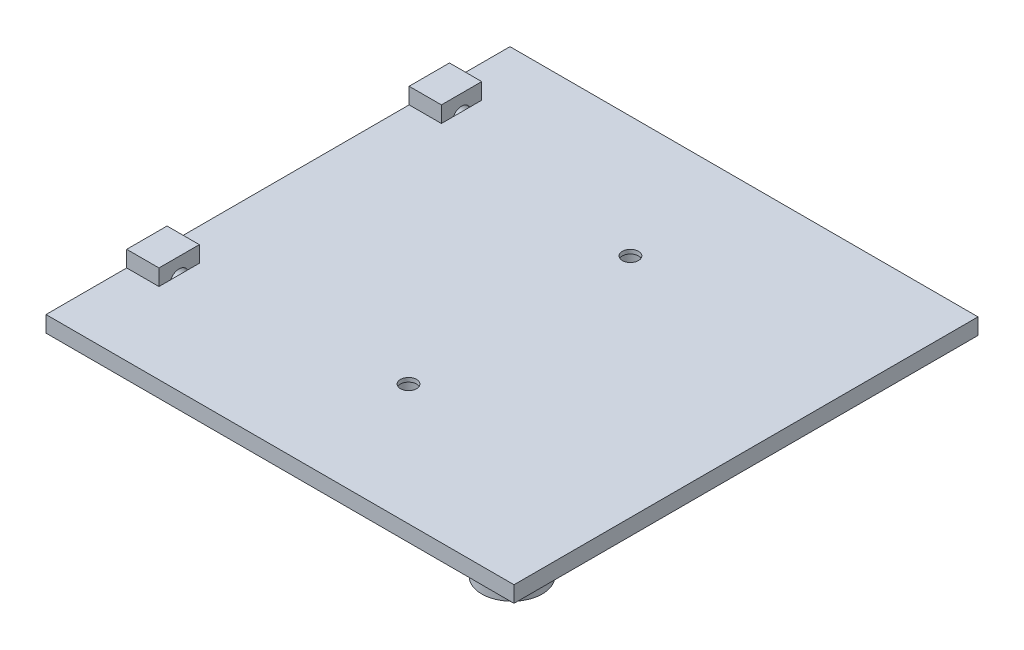
ISO-10303-21;
HEADER;
FILE_DESCRIPTION(('STEP AP214'),'2;1');
FILE_NAME('part.step','',(''),(''),'','','');
FILE_SCHEMA(('AUTOMOTIVE_DESIGN { 1 0 10303 214 1 1 1 1 }'));
ENDSEC;
DATA;
#1=APPLICATION_CONTEXT('core data for automotive mechanical design processes');
#2=APPLICATION_PROTOCOL_DEFINITION('international standard','automotive_design',2000,#1);
#3=PRODUCT_CONTEXT('',#1,'mechanical');
#4=PRODUCT('Part','Part','',(#3));
#5=PRODUCT_RELATED_PRODUCT_CATEGORY('part','',(#4));
#6=PRODUCT_DEFINITION_FORMATION('','',#4);
#7=PRODUCT_DEFINITION_CONTEXT('part definition',#1,'design');
#8=PRODUCT_DEFINITION('design','',#6,#7);
#9=PRODUCT_DEFINITION_SHAPE('','',#8);
#10=(LENGTH_UNIT() NAMED_UNIT(*) SI_UNIT(.MILLI.,.METRE.));
#11=(NAMED_UNIT(*) PLANE_ANGLE_UNIT() SI_UNIT($,.RADIAN.));
#12=(NAMED_UNIT(*) SI_UNIT($,.STERADIAN.) SOLID_ANGLE_UNIT());
#13=UNCERTAINTY_MEASURE_WITH_UNIT(LENGTH_MEASURE(1.E-05),#10,'distance_accuracy_value','');
#14=(GEOMETRIC_REPRESENTATION_CONTEXT(3) GLOBAL_UNCERTAINTY_ASSIGNED_CONTEXT((#13)) GLOBAL_UNIT_ASSIGNED_CONTEXT((#10,
#11,#12)) REPRESENTATION_CONTEXT('',''));
#15=CARTESIAN_POINT('',(0.,0.,0.));
#16=DIRECTION('',(0.,0.,1.));
#17=DIRECTION('',(1.,0.,0.));
#18=AXIS2_PLACEMENT_3D('',#15,#16,#17);
#19=CARTESIAN_POINT('',(-33.4296407851256,8.,50.6024096385542));
#20=DIRECTION('',(0.,-1.,0.));
#21=DIRECTION('',(0.,0.,-1.));
#22=AXIS2_PLACEMENT_3D('',#19,#20,#21);
#23=CYLINDRICAL_SURFACE('',#22,2.);
#24=CARTESIAN_POINT('',(-33.4296407851256,4.,50.6024096385542));
#25=DIRECTION('',(0.,1.,0.));
#26=DIRECTION('',(0.,0.,1.));
#27=AXIS2_PLACEMENT_3D('',#24,#25,#26);
#28=CIRCLE('',#27,2.);
#29=CARTESIAN_POINT('',(-33.4296407851256,4.,52.6024096385542));
#30=VERTEX_POINT('',#29);
#31=EDGE_CURVE('E266',#30,#30,#28,.F.);
#32=ORIENTED_EDGE('',*,*,#31,.F.);
#33=EDGE_LOOP('',(#32));
#34=FACE_BOUND('',#33,.T.);
#35=CARTESIAN_POINT('',(-33.4296407851256,3.,50.6024096385542));
#36=DIRECTION('',(0.,-1.,0.));
#37=DIRECTION('',(0.,0.,-1.));
#38=AXIS2_PLACEMENT_3D('',#35,#36,#37);
#39=CIRCLE('',#38,2.);
#40=CARTESIAN_POINT('',(-33.4296407851256,3.,48.6024096385542));
#41=VERTEX_POINT('',#40);
#42=EDGE_CURVE('E36',#41,#41,#39,.T.);
#43=ORIENTED_EDGE('',*,*,#42,.T.);
#44=EDGE_LOOP('',(#43));
#45=FACE_BOUND('',#44,.T.);
#46=ADVANCED_FACE('F32',(#34,#45),#23,.F.);
#47=CARTESIAN_POINT('',(-33.4296407851256,8.,-4.39759036144576));
#48=DIRECTION('',(0.,-1.,0.));
#49=DIRECTION('',(0.,0.,-1.));
#50=AXIS2_PLACEMENT_3D('',#47,#48,#49);
#51=CYLINDRICAL_SURFACE('',#50,2.);
#52=CARTESIAN_POINT('',(-33.4296407851256,4.,-4.39759036144576));
#53=DIRECTION('',(0.,1.,0.));
#54=DIRECTION('',(0.,0.,1.));
#55=AXIS2_PLACEMENT_3D('',#52,#53,#54);
#56=CIRCLE('',#55,2.);
#57=CARTESIAN_POINT('',(-33.4296407851256,4.,-2.39759036144576));
#58=VERTEX_POINT('',#57);
#59=EDGE_CURVE('E283',#58,#58,#56,.F.);
#60=ORIENTED_EDGE('',*,*,#59,.F.);
#61=EDGE_LOOP('',(#60));
#62=FACE_BOUND('',#61,.T.);
#63=CARTESIAN_POINT('',(-33.4296407851256,3.,-4.39759036144576));
#64=DIRECTION('',(0.,-1.,0.));
#65=DIRECTION('',(0.,0.,-1.));
#66=AXIS2_PLACEMENT_3D('',#63,#64,#65);
#67=CIRCLE('',#66,2.);
#68=CARTESIAN_POINT('',(-33.4296407851256,3.,-6.39759036144577));
#69=VERTEX_POINT('',#68);
#70=EDGE_CURVE('E260',#69,#69,#67,.T.);
#71=ORIENTED_EDGE('',*,*,#70,.T.);
#72=EDGE_LOOP('',(#71));
#73=FACE_BOUND('',#72,.T.);
#74=ADVANCED_FACE('F298',(#62,#73),#51,.F.);
#75=CARTESIAN_POINT('',(-93.2831325301205,4.,-34.3975903614458));
#76=DIRECTION('',(1.,0.,0.));
#77=DIRECTION('',(0.,0.,-1.));
#78=AXIS2_PLACEMENT_3D('',#75,#76,#77);
#79=PLANE('',#78);
#80=CARTESIAN_POINT('',(-93.2831325301205,3.,-14.3975903614458));
#81=DIRECTION('',(-1.,0.,0.));
#82=DIRECTION('',(0.,0.,1.));
#83=AXIS2_PLACEMENT_3D('',#80,#81,#82);
#84=CIRCLE('',#83,2.2256094163191);
#85=CARTESIAN_POINT('',(-93.2831325301205,3.,-12.1719809451267));
#86=VERTEX_POINT('',#85);
#87=EDGE_CURVE('E146',#86,#86,#84,.T.);
#88=ORIENTED_EDGE('',*,*,#87,.F.);
#89=EDGE_LOOP('',(#88));
#90=FACE_BOUND('',#89,.T.);
#91=CARTESIAN_POINT('',(-93.2831325301205,3.,55.6024096385542));
#92=DIRECTION('',(-1.,0.,0.));
#93=DIRECTION('',(0.,0.,1.));
#94=AXIS2_PLACEMENT_3D('',#91,#92,#93);
#95=CIRCLE('',#94,2.30252444093149);
#96=CARTESIAN_POINT('',(-93.2831325301205,3.,57.9049340794857));
#97=VERTEX_POINT('',#96);
#98=EDGE_CURVE('E138',#97,#97,#95,.T.);
#99=ORIENTED_EDGE('',*,*,#98,.F.);
#100=EDGE_LOOP('',(#99));
#101=FACE_BOUND('',#100,.T.);
#102=DIRECTION('',(0.,0.,1.));
#103=VECTOR('',#102,1.);
#104=CARTESIAN_POINT('',(-93.2831325301205,0.,-34.3975903614458));
#105=LINE('',#104,#103);
#106=CARTESIAN_POINT('',(-93.2831325301205,0.,-34.3975903614458));
#107=VERTEX_POINT('',#106);
#108=CARTESIAN_POINT('',(-93.2831325301205,0.,80.6024096385542));
#109=VERTEX_POINT('',#108);
#110=EDGE_CURVE('E225',#107,#109,#105,.T.);
#111=ORIENTED_EDGE('',*,*,#110,.T.);
#112=DIRECTION('',(0.,-1.,0.));
#113=VECTOR('',#112,1.);
#114=CARTESIAN_POINT('',(-93.2831325301205,4.,80.6024096385542));
#115=LINE('',#114,#113);
#116=CARTESIAN_POINT('',(-93.2831325301205,4.,80.6024096385542));
#117=VERTEX_POINT('',#116);
#118=EDGE_CURVE('E256',#117,#109,#115,.T.);
#119=ORIENTED_EDGE('',*,*,#118,.F.);
#120=DIRECTION('',(0.,0.,1.));
#121=VECTOR('',#120,1.);
#122=CARTESIAN_POINT('',(-93.2831325301205,4.,-34.3975903614458));
#123=LINE('',#122,#121);
#124=CARTESIAN_POINT('',(-93.2831325301205,4.,60.6024096385542));
#125=VERTEX_POINT('',#124);
#126=EDGE_CURVE('E233',#125,#117,#123,.T.);
#127=ORIENTED_EDGE('',*,*,#126,.F.);
#128=DIRECTION('',(0.,1.,0.));
#129=VECTOR('',#128,1.);
#130=CARTESIAN_POINT('',(-93.2831325301205,4.,60.6024096385542));
#131=LINE('',#130,#129);
#132=CARTESIAN_POINT('',(-93.2831325301205,8.,60.6024096385542));
#133=VERTEX_POINT('',#132);
#134=EDGE_CURVE('E171',#125,#133,#131,.T.);
#135=ORIENTED_EDGE('',*,*,#134,.T.);
#136=DIRECTION('',(0.,0.,-1.));
#137=VECTOR('',#136,1.);
#138=CARTESIAN_POINT('',(-93.2831325301205,8.,50.6024096385542));
#139=LINE('',#138,#137);
#140=CARTESIAN_POINT('',(-93.2831325301205,8.,50.6024096385542));
#141=VERTEX_POINT('',#140);
#142=EDGE_CURVE('E175',#133,#141,#139,.T.);
#143=ORIENTED_EDGE('',*,*,#142,.T.);
#144=DIRECTION('',(0.,-1.,0.));
#145=VECTOR('',#144,1.);
#146=CARTESIAN_POINT('',(-93.2831325301205,4.,50.6024096385542));
#147=LINE('',#146,#145);
#148=CARTESIAN_POINT('',(-93.2831325301205,4.,50.6024096385542));
#149=VERTEX_POINT('',#148);
#150=EDGE_CURVE('E168',#141,#149,#147,.T.);
#151=ORIENTED_EDGE('',*,*,#150,.T.);
#152=CARTESIAN_POINT('',(-93.2831325301205,4.,-9.39759036144578));
#153=VERTEX_POINT('',#152);
#154=EDGE_CURVE('E232',#153,#149,#123,.T.);
#155=ORIENTED_EDGE('',*,*,#154,.F.);
#156=DIRECTION('',(0.,1.,0.));
#157=VECTOR('',#156,1.);
#158=CARTESIAN_POINT('',(-93.2831325301205,4.,-9.39759036144577));
#159=LINE('',#158,#157);
#160=CARTESIAN_POINT('',(-93.2831325301205,8.,-9.39759036144577));
#161=VERTEX_POINT('',#160);
#162=EDGE_CURVE('E205',#153,#161,#159,.T.);
#163=ORIENTED_EDGE('',*,*,#162,.T.);
#164=DIRECTION('',(0.,0.,-1.));
#165=VECTOR('',#164,1.);
#166=CARTESIAN_POINT('',(-93.2831325301205,8.,-19.3975903614458));
#167=LINE('',#166,#165);
#168=CARTESIAN_POINT('',(-93.2831325301205,8.,-19.3975903614458));
#169=VERTEX_POINT('',#168);
#170=EDGE_CURVE('E191',#161,#169,#167,.T.);
#171=ORIENTED_EDGE('',*,*,#170,.T.);
#172=DIRECTION('',(0.,-1.,0.));
#173=VECTOR('',#172,1.);
#174=CARTESIAN_POINT('',(-93.2831325301205,4.,-19.3975903614458));
#175=LINE('',#174,#173);
#176=CARTESIAN_POINT('',(-93.2831325301205,4.,-19.3975903614458));
#177=VERTEX_POINT('',#176);
#178=EDGE_CURVE('E180',#169,#177,#175,.T.);
#179=ORIENTED_EDGE('',*,*,#178,.T.);
#180=CARTESIAN_POINT('',(-93.2831325301205,4.,-34.3975903614458));
#181=VERTEX_POINT('',#180);
#182=EDGE_CURVE('E228',#181,#177,#123,.T.);
#183=ORIENTED_EDGE('',*,*,#182,.F.);
#184=DIRECTION('',(0.,-1.,0.));
#185=VECTOR('',#184,1.);
#186=CARTESIAN_POINT('',(-93.2831325301205,4.,-34.3975903614458));
#187=LINE('',#186,#185);
#188=EDGE_CURVE('E239',#181,#107,#187,.T.);
#189=ORIENTED_EDGE('',*,*,#188,.T.);
#190=EDGE_LOOP('',(#111,#119,#127,#135,#143,#151,#155,#163,#171,#179,#183,#189));
#191=FACE_BOUND('',#190,.T.);
#192=ADVANCED_FACE('F34',(#90,#101,#191),#79,.F.);
#193=CARTESIAN_POINT('',(-93.2831325301205,4.,80.6024096385542));
#194=DIRECTION('',(0.,0.,-1.));
#195=DIRECTION('',(-1.,0.,0.));
#196=AXIS2_PLACEMENT_3D('',#193,#194,#195);
#197=PLANE('',#196);
#198=DIRECTION('',(1.,0.,0.));
#199=VECTOR('',#198,1.);
#200=CARTESIAN_POINT('',(-93.2831325301205,0.,80.6024096385542));
#201=LINE('',#200,#199);
#202=CARTESIAN_POINT('',(22.7168674698795,0.,80.6024096385542));
#203=VERTEX_POINT('',#202);
#204=EDGE_CURVE('E242',#109,#203,#201,.T.);
#205=ORIENTED_EDGE('',*,*,#204,.T.);
#206=DIRECTION('',(0.,-1.,0.));
#207=VECTOR('',#206,1.);
#208=CARTESIAN_POINT('',(22.7168674698795,4.,80.6024096385542));
#209=LINE('',#208,#207);
#210=CARTESIAN_POINT('',(22.7168674698795,4.,80.6024096385542));
#211=VERTEX_POINT('',#210);
#212=EDGE_CURVE('E253',#211,#203,#209,.T.);
#213=ORIENTED_EDGE('',*,*,#212,.F.);
#214=DIRECTION('',(1.,0.,0.));
#215=VECTOR('',#214,1.);
#216=CARTESIAN_POINT('',(-93.2831325301205,4.,80.6024096385542));
#217=LINE('',#216,#215);
#218=EDGE_CURVE('E231',#117,#211,#217,.T.);
#219=ORIENTED_EDGE('',*,*,#218,.F.);
#220=ORIENTED_EDGE('',*,*,#118,.T.);
#221=EDGE_LOOP('',(#205,#213,#219,#220));
#222=FACE_BOUND('',#221,.T.);
#223=ADVANCED_FACE('F297',(#222),#197,.F.);
#224=CARTESIAN_POINT('',(22.7168674698795,4.,-34.3975903614458));
#225=DIRECTION('',(-1.,0.,0.));
#226=DIRECTION('',(0.,0.,1.));
#227=AXIS2_PLACEMENT_3D('',#224,#225,#226);
#228=PLANE('',#227);
#229=DIRECTION('',(0.,0.,-1.));
#230=VECTOR('',#229,1.);
#231=CARTESIAN_POINT('',(22.7168674698795,0.,-34.3975903614458));
#232=LINE('',#231,#230);
#233=CARTESIAN_POINT('',(22.7168674698795,0.,-34.3975903614458));
#234=VERTEX_POINT('',#233);
#235=EDGE_CURVE('E244',#203,#234,#232,.T.);
#236=ORIENTED_EDGE('',*,*,#235,.T.);
#237=DIRECTION('',(0.,-1.,0.));
#238=VECTOR('',#237,1.);
#239=CARTESIAN_POINT('',(22.7168674698795,4.,-34.3975903614458));
#240=LINE('',#239,#238);
#241=CARTESIAN_POINT('',(22.7168674698795,4.,-34.3975903614458));
#242=VERTEX_POINT('',#241);
#243=EDGE_CURVE('E250',#242,#234,#240,.T.);
#244=ORIENTED_EDGE('',*,*,#243,.F.);
#245=DIRECTION('',(0.,0.,-1.));
#246=VECTOR('',#245,1.);
#247=CARTESIAN_POINT('',(22.7168674698795,4.,-34.3975903614458));
#248=LINE('',#247,#246);
#249=EDGE_CURVE('E235',#211,#242,#248,.T.);
#250=ORIENTED_EDGE('',*,*,#249,.F.);
#251=ORIENTED_EDGE('',*,*,#212,.T.);
#252=EDGE_LOOP('',(#236,#244,#250,#251));
#253=FACE_BOUND('',#252,.T.);
#254=ADVANCED_FACE('F526',(#253),#228,.F.);
#255=CARTESIAN_POINT('',(-93.2831325301205,4.,-34.3975903614458));
#256=DIRECTION('',(0.,0.,1.));
#257=DIRECTION('',(1.,0.,0.));
#258=AXIS2_PLACEMENT_3D('',#255,#256,#257);
#259=PLANE('',#258);
#260=DIRECTION('',(-1.,0.,0.));
#261=VECTOR('',#260,1.);
#262=CARTESIAN_POINT('',(-93.2831325301205,0.,-34.3975903614458));
#263=LINE('',#262,#261);
#264=EDGE_CURVE('E246',#234,#107,#263,.T.);
#265=ORIENTED_EDGE('',*,*,#264,.T.);
#266=ORIENTED_EDGE('',*,*,#188,.F.);
#267=DIRECTION('',(-1.,0.,0.));
#268=VECTOR('',#267,1.);
#269=CARTESIAN_POINT('',(-93.2831325301205,4.,-34.3975903614458));
#270=LINE('',#269,#268);
#271=EDGE_CURVE('E237',#242,#181,#270,.T.);
#272=ORIENTED_EDGE('',*,*,#271,.F.);
#273=ORIENTED_EDGE('',*,*,#243,.T.);
#274=EDGE_LOOP('',(#265,#266,#272,#273));
#275=FACE_BOUND('',#274,.T.);
#276=ADVANCED_FACE('F532',(#275),#259,.F.);
#277=CARTESIAN_POINT('',(0.,4.,0.));
#278=DIRECTION('',(0.,1.,0.));
#279=DIRECTION('',(0.,0.,1.));
#280=AXIS2_PLACEMENT_3D('',#277,#278,#279);
#281=PLANE('',#280);
#282=ORIENTED_EDGE('',*,*,#59,.T.);
#283=EDGE_LOOP('',(#282));
#284=FACE_BOUND('',#283,.T.);
#285=ORIENTED_EDGE('',*,*,#31,.T.);
#286=EDGE_LOOP('',(#285));
#287=FACE_BOUND('',#286,.T.);
#288=DIRECTION('',(-1.,0.,0.));
#289=VECTOR('',#288,1.);
#290=CARTESIAN_POINT('',(-85.2831325301205,4.,50.6024096385542));
#291=LINE('',#290,#289);
#292=CARTESIAN_POINT('',(-85.2831325301205,4.,50.6024096385542));
#293=VERTEX_POINT('',#292);
#294=EDGE_CURVE('E167',#293,#149,#291,.T.);
#295=ORIENTED_EDGE('',*,*,#294,.F.);
#296=DIRECTION('',(0.,0.,1.));
#297=VECTOR('',#296,1.);
#298=CARTESIAN_POINT('',(-85.2831325301205,4.,50.6024096385542));
#299=LINE('',#298,#297);
#300=CARTESIAN_POINT('',(-85.2831325301205,4.,53.5283752123484));
#301=VERTEX_POINT('',#300);
#302=EDGE_CURVE('E158',#293,#301,#299,.T.);
#303=ORIENTED_EDGE('',*,*,#302,.T.);
#304=CARTESIAN_POINT('',(-85.2831325301205,4.,57.6764440647601));
#305=VERTEX_POINT('',#304);
#306=EDGE_CURVE('E135',#301,#305,#299,.T.);
#307=ORIENTED_EDGE('',*,*,#306,.T.);
#308=CARTESIAN_POINT('',(-85.2831325301205,4.,60.6024096385542));
#309=VERTEX_POINT('',#308);
#310=EDGE_CURVE('E148',#305,#309,#299,.T.);
#311=ORIENTED_EDGE('',*,*,#310,.T.);
#312=DIRECTION('',(-1.,0.,0.));
#313=VECTOR('',#312,1.);
#314=CARTESIAN_POINT('',(-85.2831325301205,4.,60.6024096385542));
#315=LINE('',#314,#313);
#316=EDGE_CURVE('E183',#309,#125,#315,.T.);
#317=ORIENTED_EDGE('',*,*,#316,.T.);
#318=ORIENTED_EDGE('',*,*,#126,.T.);
#319=ORIENTED_EDGE('',*,*,#218,.T.);
#320=ORIENTED_EDGE('',*,*,#249,.T.);
#321=ORIENTED_EDGE('',*,*,#271,.T.);
#322=ORIENTED_EDGE('',*,*,#182,.T.);
#323=DIRECTION('',(-1.,0.,0.));
#324=VECTOR('',#323,1.);
#325=CARTESIAN_POINT('',(-85.2831325301205,4.,-19.3975903614458));
#326=LINE('',#325,#324);
#327=CARTESIAN_POINT('',(-85.2831325301205,4.,-19.3975903614458));
#328=VERTEX_POINT('',#327);
#329=EDGE_CURVE('E202',#328,#177,#326,.T.);
#330=ORIENTED_EDGE('',*,*,#329,.F.);
#331=DIRECTION('',(0.,0.,1.));
#332=VECTOR('',#331,1.);
#333=CARTESIAN_POINT('',(-85.2831325301205,4.,-19.3975903614458));
#334=LINE('',#333,#332);
#335=CARTESIAN_POINT('',(-85.2831325301205,4.,-16.3858904580127));
#336=VERTEX_POINT('',#335);
#337=EDGE_CURVE('E192',#328,#336,#334,.T.);
#338=ORIENTED_EDGE('',*,*,#337,.T.);
#339=CARTESIAN_POINT('',(-85.2831325301205,4.,-12.4092902648788));
#340=VERTEX_POINT('',#339);
#341=EDGE_CURVE('E196',#336,#340,#334,.T.);
#342=ORIENTED_EDGE('',*,*,#341,.T.);
#343=CARTESIAN_POINT('',(-85.2831325301205,4.,-9.39759036144577));
#344=VERTEX_POINT('',#343);
#345=EDGE_CURVE('E190',#340,#344,#334,.T.);
#346=ORIENTED_EDGE('',*,*,#345,.T.);
#347=DIRECTION('',(-1.,0.,0.));
#348=VECTOR('',#347,1.);
#349=CARTESIAN_POINT('',(-85.2831325301205,4.,-9.39759036144577));
#350=LINE('',#349,#348);
#351=EDGE_CURVE('E215',#344,#153,#350,.T.);
#352=ORIENTED_EDGE('',*,*,#351,.T.);
#353=ORIENTED_EDGE('',*,*,#154,.T.);
#354=EDGE_LOOP('',(#295,#303,#307,#311,#317,#318,#319,#320,#321,#322,#330,#338,#342,#346,#352,#353));
#355=FACE_BOUND('',#354,.T.);
#356=ADVANCED_FACE('F159',(#284,#287,#355),#281,.T.);
#357=CARTESIAN_POINT('',(0.,0.,0.));
#358=DIRECTION('',(0.,1.,0.));
#359=DIRECTION('',(0.,0.,1.));
#360=AXIS2_PLACEMENT_3D('',#357,#358,#359);
#361=PLANE('',#360);
#362=CARTESIAN_POINT('',(-33.4296407851256,0.,-4.39759036144576));
#363=DIRECTION('',(0.,-1.,0.));
#364=DIRECTION('',(0.,0.,-1.));
#365=AXIS2_PLACEMENT_3D('',#362,#363,#364);
#366=CIRCLE('',#365,3.5);
#367=CARTESIAN_POINT('',(-33.4296407851256,0.,-7.89759036144576));
#368=VERTEX_POINT('',#367);
#369=EDGE_CURVE('E268',#368,#368,#366,.T.);
#370=ORIENTED_EDGE('',*,*,#369,.F.);
#371=EDGE_LOOP('',(#370));
#372=FACE_BOUND('',#371,.T.);
#373=CARTESIAN_POINT('',(-33.4296407851256,0.,50.6024096385542));
#374=DIRECTION('',(0.,-1.,0.));
#375=DIRECTION('',(0.,0.,-1.));
#376=AXIS2_PLACEMENT_3D('',#373,#374,#375);
#377=CIRCLE('',#376,3.5);
#378=CARTESIAN_POINT('',(-33.4296407851256,0.,47.1024096385542));
#379=VERTEX_POINT('',#378);
#380=EDGE_CURVE('E278',#379,#379,#377,.T.);
#381=ORIENTED_EDGE('',*,*,#380,.F.);
#382=EDGE_LOOP('',(#381));
#383=FACE_BOUND('',#382,.T.);
#384=CARTESIAN_POINT('',(2.71686746987954,0.,-14.3975903614458));
#385=DIRECTION('',(0.,1.,0.));
#386=DIRECTION('',(0.,0.,1.));
#387=AXIS2_PLACEMENT_3D('',#384,#385,#386);
#388=CIRCLE('',#387,5.);
#389=CARTESIAN_POINT('',(2.71686746987954,0.,-9.39759036144576));
#390=VERTEX_POINT('',#389);
#391=EDGE_CURVE('E11',#390,#390,#388,.F.);
#392=ORIENTED_EDGE('',*,*,#391,.F.);
#393=EDGE_LOOP('',(#392));
#394=FACE_BOUND('',#393,.T.);
#395=CARTESIAN_POINT('',(14.2168674698795,0.,72.6024096385542));
#396=DIRECTION('',(0.,1.,0.));
#397=DIRECTION('',(0.,0.,1.));
#398=AXIS2_PLACEMENT_3D('',#395,#396,#397);
#399=CIRCLE('',#398,7.5);
#400=CARTESIAN_POINT('',(14.2168674698795,0.,80.1024096385542));
#401=VERTEX_POINT('',#400);
#402=EDGE_CURVE('E221',#401,#401,#399,.T.);
#403=ORIENTED_EDGE('',*,*,#402,.T.);
#404=EDGE_LOOP('',(#403));
#405=FACE_BOUND('',#404,.T.);
#406=ORIENTED_EDGE('',*,*,#110,.F.);
#407=ORIENTED_EDGE('',*,*,#264,.F.);
#408=ORIENTED_EDGE('',*,*,#235,.F.);
#409=ORIENTED_EDGE('',*,*,#204,.F.);
#410=EDGE_LOOP('',(#406,#407,#408,#409));
#411=FACE_BOUND('',#410,.T.);
#412=ADVANCED_FACE('F306',(#372,#383,#394,#405,#411),#361,.F.);
#413=CARTESIAN_POINT('',(14.2168674698795,-2.5,72.6024096385542));
#414=DIRECTION('',(0.,1.,0.));
#415=DIRECTION('',(0.,0.,1.));
#416=AXIS2_PLACEMENT_3D('',#413,#414,#415);
#417=CYLINDRICAL_SURFACE('',#416,7.5);
#418=CARTESIAN_POINT('',(14.2168674698795,-2.5,72.6024096385542));
#419=DIRECTION('',(0.,1.,0.));
#420=DIRECTION('',(0.,0.,1.));
#421=AXIS2_PLACEMENT_3D('',#418,#419,#420);
#422=CIRCLE('',#421,7.5);
#423=CARTESIAN_POINT('',(14.2168674698795,-2.5,80.1024096385542));
#424=VERTEX_POINT('',#423);
#425=EDGE_CURVE('E222',#424,#424,#422,.T.);
#426=ORIENTED_EDGE('',*,*,#425,.T.);
#427=EDGE_LOOP('',(#426));
#428=FACE_BOUND('',#427,.T.);
#429=ORIENTED_EDGE('',*,*,#402,.F.);
#430=EDGE_LOOP('',(#429));
#431=FACE_BOUND('',#430,.T.);
#432=ADVANCED_FACE('F553',(#428,#431),#417,.T.);
#433=CARTESIAN_POINT('',(14.2168674698795,-2.5,72.6024096385542));
#434=DIRECTION('',(0.,1.,0.));
#435=DIRECTION('',(0.,0.,1.));
#436=AXIS2_PLACEMENT_3D('',#433,#434,#435);
#437=PLANE('',#436);
#438=CARTESIAN_POINT('',(14.2168674698795,-2.5,72.6024096385542));
#439=DIRECTION('',(0.,1.,0.));
#440=DIRECTION('',(0.,0.,1.));
#441=AXIS2_PLACEMENT_3D('',#438,#439,#440);
#442=CIRCLE('',#441,5.);
#443=CARTESIAN_POINT('',(14.2168674698795,-2.5,77.6024096385542));
#444=VERTEX_POINT('',#443);
#445=EDGE_CURVE('E212',#444,#444,#442,.T.);
#446=ORIENTED_EDGE('',*,*,#445,.T.);
#447=EDGE_LOOP('',(#446));
#448=FACE_BOUND('',#447,.T.);
#449=ORIENTED_EDGE('',*,*,#425,.F.);
#450=EDGE_LOOP('',(#449));
#451=FACE_BOUND('',#450,.T.);
#452=ADVANCED_FACE('F560',(#448,#451),#437,.F.);
#453=CARTESIAN_POINT('',(14.2168674698795,-2.5,72.6024096385542));
#454=DIRECTION('',(0.,1.,0.));
#455=DIRECTION('',(0.,0.,1.));
#456=AXIS2_PLACEMENT_3D('',#453,#454,#455);
#457=CYLINDRICAL_SURFACE('',#456,5.);
#458=ORIENTED_EDGE('',*,*,#445,.F.);
#459=EDGE_LOOP('',(#458));
#460=FACE_BOUND('',#459,.T.);
#461=CARTESIAN_POINT('',(14.2168674698795,0.,72.6024096385542));
#462=DIRECTION('',(0.,1.,0.));
#463=DIRECTION('',(0.,0.,1.));
#464=AXIS2_PLACEMENT_3D('',#461,#462,#463);
#465=CIRCLE('',#464,5.);
#466=CARTESIAN_POINT('',(14.2168674698795,0.,77.6024096385542));
#467=VERTEX_POINT('',#466);
#468=EDGE_CURVE('E41',#467,#467,#465,.T.);
#469=ORIENTED_EDGE('',*,*,#468,.T.);
#470=EDGE_LOOP('',(#469));
#471=FACE_BOUND('',#470,.T.);
#472=ADVANCED_FACE('F568',(#460,#471),#457,.F.);
#473=ORIENTED_EDGE('',*,*,#468,.F.);
#474=EDGE_LOOP('',(#473));
#475=FACE_BOUND('',#474,.T.);
#476=ADVANCED_FACE('F507',(#475),#361,.F.);
#477=CARTESIAN_POINT('',(-85.2831325301205,4.,-19.3975903614458));
#478=DIRECTION('',(0.,0.,-1.));
#479=DIRECTION('',(-1.,0.,0.));
#480=AXIS2_PLACEMENT_3D('',#477,#478,#479);
#481=PLANE('',#480);
#482=ORIENTED_EDGE('',*,*,#178,.F.);
#483=DIRECTION('',(-1.,0.,0.));
#484=VECTOR('',#483,1.);
#485=CARTESIAN_POINT('',(-85.2831325301205,8.,-19.3975903614458));
#486=LINE('',#485,#484);
#487=CARTESIAN_POINT('',(-85.2831325301205,8.,-19.3975903614458));
#488=VERTEX_POINT('',#487);
#489=EDGE_CURVE('E210',#488,#169,#486,.T.);
#490=ORIENTED_EDGE('',*,*,#489,.F.);
#491=DIRECTION('',(0.,-1.,0.));
#492=VECTOR('',#491,1.);
#493=CARTESIAN_POINT('',(-85.2831325301205,4.,-19.3975903614458));
#494=LINE('',#493,#492);
#495=EDGE_CURVE('E187',#488,#328,#494,.T.);
#496=ORIENTED_EDGE('',*,*,#495,.T.);
#497=ORIENTED_EDGE('',*,*,#329,.T.);
#498=EDGE_LOOP('',(#482,#490,#496,#497));
#499=FACE_BOUND('',#498,.T.);
#500=ADVANCED_FACE('F498',(#499),#481,.T.);
#501=CARTESIAN_POINT('',(-85.2831325301205,8.,-19.3975903614458));
#502=DIRECTION('',(0.,1.,0.));
#503=DIRECTION('',(0.,0.,1.));
#504=AXIS2_PLACEMENT_3D('',#501,#502,#503);
#505=PLANE('',#504);
#506=ORIENTED_EDGE('',*,*,#170,.F.);
#507=DIRECTION('',(-1.,0.,0.));
#508=VECTOR('',#507,1.);
#509=CARTESIAN_POINT('',(-85.2831325301205,8.,-9.39759036144577));
#510=LINE('',#509,#508);
#511=CARTESIAN_POINT('',(-85.2831325301205,8.,-9.39759036144577));
#512=VERTEX_POINT('',#511);
#513=EDGE_CURVE('E213',#512,#161,#510,.T.);
#514=ORIENTED_EDGE('',*,*,#513,.F.);
#515=DIRECTION('',(0.,0.,-1.));
#516=VECTOR('',#515,1.);
#517=CARTESIAN_POINT('',(-85.2831325301205,8.,-19.3975903614458));
#518=LINE('',#517,#516);
#519=EDGE_CURVE('E199',#512,#488,#518,.T.);
#520=ORIENTED_EDGE('',*,*,#519,.T.);
#521=ORIENTED_EDGE('',*,*,#489,.T.);
#522=EDGE_LOOP('',(#506,#514,#520,#521));
#523=FACE_BOUND('',#522,.T.);
#524=ADVANCED_FACE('F489',(#523),#505,.T.);
#525=CARTESIAN_POINT('',(-85.2831325301205,4.,-9.39759036144577));
#526=DIRECTION('',(0.,0.,1.));
#527=DIRECTION('',(1.,0.,0.));
#528=AXIS2_PLACEMENT_3D('',#525,#526,#527);
#529=PLANE('',#528);
#530=ORIENTED_EDGE('',*,*,#162,.F.);
#531=ORIENTED_EDGE('',*,*,#351,.F.);
#532=DIRECTION('',(0.,1.,0.));
#533=VECTOR('',#532,1.);
#534=CARTESIAN_POINT('',(-85.2831325301205,4.,-9.39759036144577));
#535=LINE('',#534,#533);
#536=EDGE_CURVE('E195',#344,#512,#535,.T.);
#537=ORIENTED_EDGE('',*,*,#536,.T.);
#538=ORIENTED_EDGE('',*,*,#513,.T.);
#539=EDGE_LOOP('',(#530,#531,#537,#538));
#540=FACE_BOUND('',#539,.T.);
#541=ADVANCED_FACE('F481',(#540),#529,.T.);
#542=CARTESIAN_POINT('',(-85.2831325301205,0.,0.));
#543=DIRECTION('',(1.,0.,0.));
#544=DIRECTION('',(0.,0.,-1.));
#545=AXIS2_PLACEMENT_3D('',#542,#543,#544);
#546=PLANE('',#545);
#547=CARTESIAN_POINT('',(-85.2831325301205,3.,-14.3975903614458));
#548=DIRECTION('',(-1.,0.,0.));
#549=DIRECTION('',(0.,0.,1.));
#550=AXIS2_PLACEMENT_3D('',#547,#548,#549);
#551=CIRCLE('',#550,2.2256094163191);
#552=EDGE_CURVE('E172',#340,#336,#551,.T.);
#553=ORIENTED_EDGE('',*,*,#552,.T.);
#554=ORIENTED_EDGE('',*,*,#337,.F.);
#555=ORIENTED_EDGE('',*,*,#495,.F.);
#556=ORIENTED_EDGE('',*,*,#519,.F.);
#557=ORIENTED_EDGE('',*,*,#536,.F.);
#558=ORIENTED_EDGE('',*,*,#345,.F.);
#559=EDGE_LOOP('',(#553,#554,#555,#556,#557,#558));
#560=FACE_BOUND('',#559,.T.);
#561=ADVANCED_FACE('F474',(#560),#546,.T.);
#562=CARTESIAN_POINT('',(-85.2831325301205,4.,50.6024096385542));
#563=DIRECTION('',(0.,0.,-1.));
#564=DIRECTION('',(-1.,0.,0.));
#565=AXIS2_PLACEMENT_3D('',#562,#563,#564);
#566=PLANE('',#565);
#567=ORIENTED_EDGE('',*,*,#150,.F.);
#568=DIRECTION('',(-1.,0.,0.));
#569=VECTOR('',#568,1.);
#570=CARTESIAN_POINT('',(-85.2831325301205,8.,50.6024096385542));
#571=LINE('',#570,#569);
#572=CARTESIAN_POINT('',(-85.2831325301205,8.,50.6024096385542));
#573=VERTEX_POINT('',#572);
#574=EDGE_CURVE('E178',#573,#141,#571,.T.);
#575=ORIENTED_EDGE('',*,*,#574,.F.);
#576=DIRECTION('',(0.,-1.,0.));
#577=VECTOR('',#576,1.);
#578=CARTESIAN_POINT('',(-85.2831325301205,4.,50.6024096385542));
#579=LINE('',#578,#577);
#580=EDGE_CURVE('E156',#573,#293,#579,.T.);
#581=ORIENTED_EDGE('',*,*,#580,.T.);
#582=ORIENTED_EDGE('',*,*,#294,.T.);
#583=EDGE_LOOP('',(#567,#575,#581,#582));
#584=FACE_BOUND('',#583,.T.);
#585=ADVANCED_FACE('F319',(#584),#566,.T.);
#586=CARTESIAN_POINT('',(-85.2831325301205,8.,50.6024096385542));
#587=DIRECTION('',(0.,1.,0.));
#588=DIRECTION('',(0.,0.,1.));
#589=AXIS2_PLACEMENT_3D('',#586,#587,#588);
#590=PLANE('',#589);
#591=ORIENTED_EDGE('',*,*,#142,.F.);
#592=DIRECTION('',(-1.,0.,0.));
#593=VECTOR('',#592,1.);
#594=CARTESIAN_POINT('',(-85.2831325301205,8.,60.6024096385542));
#595=LINE('',#594,#593);
#596=CARTESIAN_POINT('',(-85.2831325301205,8.,60.6024096385542));
#597=VERTEX_POINT('',#596);
#598=EDGE_CURVE('E181',#597,#133,#595,.T.);
#599=ORIENTED_EDGE('',*,*,#598,.F.);
#600=DIRECTION('',(0.,0.,-1.));
#601=VECTOR('',#600,1.);
#602=CARTESIAN_POINT('',(-85.2831325301205,8.,50.6024096385542));
#603=LINE('',#602,#601);
#604=EDGE_CURVE('E164',#597,#573,#603,.T.);
#605=ORIENTED_EDGE('',*,*,#604,.T.);
#606=ORIENTED_EDGE('',*,*,#574,.T.);
#607=EDGE_LOOP('',(#591,#599,#605,#606));
#608=FACE_BOUND('',#607,.T.);
#609=ADVANCED_FACE('F323',(#608),#590,.T.);
#610=CARTESIAN_POINT('',(-85.2831325301205,4.,60.6024096385542));
#611=DIRECTION('',(0.,0.,1.));
#612=DIRECTION('',(1.,0.,0.));
#613=AXIS2_PLACEMENT_3D('',#610,#611,#612);
#614=PLANE('',#613);
#615=ORIENTED_EDGE('',*,*,#134,.F.);
#616=ORIENTED_EDGE('',*,*,#316,.F.);
#617=DIRECTION('',(0.,1.,0.));
#618=VECTOR('',#617,1.);
#619=CARTESIAN_POINT('',(-85.2831325301205,4.,60.6024096385542));
#620=LINE('',#619,#618);
#621=EDGE_CURVE('E152',#309,#597,#620,.T.);
#622=ORIENTED_EDGE('',*,*,#621,.T.);
#623=ORIENTED_EDGE('',*,*,#598,.T.);
#624=EDGE_LOOP('',(#615,#616,#622,#623));
#625=FACE_BOUND('',#624,.T.);
#626=ADVANCED_FACE('F325',(#625),#614,.T.);
#627=CARTESIAN_POINT('',(-85.2831325301205,0.,1.28490940604364E-13));
#628=DIRECTION('',(1.,0.,0.));
#629=DIRECTION('',(0.,0.,-1.));
#630=AXIS2_PLACEMENT_3D('',#627,#628,#629);
#631=PLANE('',#630);
#632=CARTESIAN_POINT('',(-85.2831325301205,3.,55.6024096385542));
#633=DIRECTION('',(-1.,0.,0.));
#634=DIRECTION('',(0.,0.,1.));
#635=AXIS2_PLACEMENT_3D('',#632,#633,#634);
#636=CIRCLE('',#635,2.30252444093149);
#637=EDGE_CURVE('E137',#305,#301,#636,.T.);
#638=ORIENTED_EDGE('',*,*,#637,.T.);
#639=ORIENTED_EDGE('',*,*,#302,.F.);
#640=ORIENTED_EDGE('',*,*,#580,.F.);
#641=ORIENTED_EDGE('',*,*,#604,.F.);
#642=ORIENTED_EDGE('',*,*,#621,.F.);
#643=ORIENTED_EDGE('',*,*,#310,.F.);
#644=EDGE_LOOP('',(#638,#639,#640,#641,#642,#643));
#645=FACE_BOUND('',#644,.T.);
#646=ADVANCED_FACE('F149',(#645),#631,.T.);
#647=CARTESIAN_POINT('',(-85.2831325301205,3.,55.6024096385542));
#648=DIRECTION('',(-1.,0.,0.));
#649=DIRECTION('',(0.,0.,1.));
#650=AXIS2_PLACEMENT_3D('',#647,#648,#649);
#651=CYLINDRICAL_SURFACE('',#650,2.30252444093149);
#652=ORIENTED_EDGE('',*,*,#637,.F.);
#653=EDGE_CURVE('E55',#301,#305,#636,.T.);
#654=ORIENTED_EDGE('',*,*,#653,.F.);
#655=EDGE_LOOP('',(#652,#654));
#656=FACE_BOUND('',#655,.T.);
#657=ORIENTED_EDGE('',*,*,#98,.T.);
#658=EDGE_LOOP('',(#657));
#659=FACE_BOUND('',#658,.T.);
#660=ADVANCED_FACE('F141',(#656,#659),#651,.F.);
#661=CARTESIAN_POINT('',(-85.2831325301205,3.,55.6024096385542));
#662=DIRECTION('',(-1.,0.,0.));
#663=DIRECTION('',(0.,0.,1.));
#664=AXIS2_PLACEMENT_3D('',#661,#662,#663);
#665=PLANE('',#664);
#666=ORIENTED_EDGE('',*,*,#653,.T.);
#667=ORIENTED_EDGE('',*,*,#306,.F.);
#668=EDGE_LOOP('',(#666,#667));
#669=FACE_BOUND('',#668,.T.);
#670=ADVANCED_FACE('F133',(#669),#665,.T.);
#671=CARTESIAN_POINT('',(-85.2831325301205,3.,-14.3975903614458));
#672=DIRECTION('',(-1.,0.,0.));
#673=DIRECTION('',(0.,0.,1.));
#674=AXIS2_PLACEMENT_3D('',#671,#672,#673);
#675=CYLINDRICAL_SURFACE('',#674,2.2256094163191);
#676=ORIENTED_EDGE('',*,*,#552,.F.);
#677=EDGE_CURVE('E48',#336,#340,#551,.T.);
#678=ORIENTED_EDGE('',*,*,#677,.F.);
#679=EDGE_LOOP('',(#676,#678));
#680=FACE_BOUND('',#679,.T.);
#681=ORIENTED_EDGE('',*,*,#87,.T.);
#682=EDGE_LOOP('',(#681));
#683=FACE_BOUND('',#682,.T.);
#684=ADVANCED_FACE('F359',(#680,#683),#675,.F.);
#685=CARTESIAN_POINT('',(-85.2831325301205,3.,-14.3975903614458));
#686=DIRECTION('',(-1.,0.,0.));
#687=DIRECTION('',(0.,0.,1.));
#688=AXIS2_PLACEMENT_3D('',#685,#686,#687);
#689=PLANE('',#688);
#690=ORIENTED_EDGE('',*,*,#677,.T.);
#691=ORIENTED_EDGE('',*,*,#341,.F.);
#692=EDGE_LOOP('',(#690,#691));
#693=FACE_BOUND('',#692,.T.);
#694=ADVANCED_FACE('F355',(#693),#689,.T.);
#695=CARTESIAN_POINT('',(2.71686746987954,-3.,-14.3975903614458));
#696=DIRECTION('',(0.,1.,0.));
#697=DIRECTION('',(0.,0.,1.));
#698=AXIS2_PLACEMENT_3D('',#695,#696,#697);
#699=CYLINDRICAL_SURFACE('',#698,5.);
#700=CARTESIAN_POINT('',(2.71686746987954,-3.,-14.3975903614458));
#701=DIRECTION('',(0.,-1.,0.));
#702=DIRECTION('',(0.,0.,-1.));
#703=AXIS2_PLACEMENT_3D('',#700,#701,#702);
#704=CIRCLE('',#703,5.);
#705=CARTESIAN_POINT('',(2.71686746987954,-3.,-19.3975903614458));
#706=VERTEX_POINT('',#705);
#707=EDGE_CURVE('E286',#706,#706,#704,.T.);
#708=ORIENTED_EDGE('',*,*,#707,.F.);
#709=EDGE_LOOP('',(#708));
#710=FACE_BOUND('',#709,.T.);
#711=ORIENTED_EDGE('',*,*,#391,.T.);
#712=EDGE_LOOP('',(#711));
#713=FACE_BOUND('',#712,.T.);
#714=ADVANCED_FACE('F351',(#710,#713),#699,.T.);
#715=CARTESIAN_POINT('',(2.71686746987954,-3.,-14.3975903614458));
#716=DIRECTION('',(0.,-1.,0.));
#717=DIRECTION('',(0.,0.,-1.));
#718=AXIS2_PLACEMENT_3D('',#715,#716,#717);
#719=PLANE('',#718);
#720=ORIENTED_EDGE('',*,*,#707,.T.);
#721=EDGE_LOOP('',(#720));
#722=FACE_BOUND('',#721,.T.);
#723=ADVANCED_FACE('F347',(#722),#719,.T.);
#724=CARTESIAN_POINT('',(-33.4296407851256,3.,-4.39759036144576));
#725=DIRECTION('',(0.,-1.,0.));
#726=DIRECTION('',(0.,0.,-1.));
#727=AXIS2_PLACEMENT_3D('',#724,#725,#726);
#728=CYLINDRICAL_SURFACE('',#727,3.5);
#729=CARTESIAN_POINT('',(-33.4296407851256,3.,-4.39759036144576));
#730=DIRECTION('',(0.,-1.,0.));
#731=DIRECTION('',(0.,0.,-1.));
#732=AXIS2_PLACEMENT_3D('',#729,#730,#731);
#733=CIRCLE('',#732,3.5);
#734=CARTESIAN_POINT('',(-33.4296407851256,3.,-7.89759036144576));
#735=VERTEX_POINT('',#734);
#736=EDGE_CURVE('E262',#735,#735,#733,.T.);
#737=ORIENTED_EDGE('',*,*,#736,.F.);
#738=EDGE_LOOP('',(#737));
#739=FACE_BOUND('',#738,.T.);
#740=ORIENTED_EDGE('',*,*,#369,.T.);
#741=EDGE_LOOP('',(#740));
#742=FACE_BOUND('',#741,.T.);
#743=ADVANCED_FACE('F350',(#739,#742),#728,.F.);
#744=CARTESIAN_POINT('',(-33.4296407851256,3.,-4.39759036144576));
#745=DIRECTION('',(0.,-1.,0.));
#746=DIRECTION('',(0.,0.,-1.));
#747=AXIS2_PLACEMENT_3D('',#744,#745,#746);
#748=PLANE('',#747);
#749=ORIENTED_EDGE('',*,*,#70,.F.);
#750=EDGE_LOOP('',(#749));
#751=FACE_BOUND('',#750,.T.);
#752=ORIENTED_EDGE('',*,*,#736,.T.);
#753=EDGE_LOOP('',(#752));
#754=FACE_BOUND('',#753,.T.);
#755=ADVANCED_FACE('F397',(#751,#754),#748,.T.);
#756=CARTESIAN_POINT('',(-33.4296407851256,3.,50.6024096385542));
#757=DIRECTION('',(0.,-1.,0.));
#758=DIRECTION('',(0.,0.,-1.));
#759=AXIS2_PLACEMENT_3D('',#756,#757,#758);
#760=CYLINDRICAL_SURFACE('',#759,3.5);
#761=CARTESIAN_POINT('',(-33.4296407851256,3.,50.6024096385542));
#762=DIRECTION('',(0.,-1.,0.));
#763=DIRECTION('',(0.,0.,-1.));
#764=AXIS2_PLACEMENT_3D('',#761,#762,#763);
#765=CIRCLE('',#764,3.5);
#766=CARTESIAN_POINT('',(-33.4296407851256,3.,47.1024096385542));
#767=VERTEX_POINT('',#766);
#768=EDGE_CURVE('E273',#767,#767,#765,.T.);
#769=ORIENTED_EDGE('',*,*,#768,.F.);
#770=EDGE_LOOP('',(#769));
#771=FACE_BOUND('',#770,.T.);
#772=ORIENTED_EDGE('',*,*,#380,.T.);
#773=EDGE_LOOP('',(#772));
#774=FACE_BOUND('',#773,.T.);
#775=ADVANCED_FACE('F406',(#771,#774),#760,.F.);
#776=CARTESIAN_POINT('',(-33.4296407851256,3.,50.6024096385542));
#777=DIRECTION('',(0.,-1.,0.));
#778=DIRECTION('',(0.,0.,-1.));
#779=AXIS2_PLACEMENT_3D('',#776,#777,#778);
#780=PLANE('',#779);
#781=ORIENTED_EDGE('',*,*,#42,.F.);
#782=EDGE_LOOP('',(#781));
#783=FACE_BOUND('',#782,.T.);
#784=ORIENTED_EDGE('',*,*,#768,.T.);
#785=EDGE_LOOP('',(#784));
#786=FACE_BOUND('',#785,.T.);
#787=ADVANCED_FACE('F414',(#783,#786),#780,.T.);
#788=CLOSED_SHELL('',(#46,#74,#192,#223,#254,#276,#356,#412,#432,#452,#472,#476,#500,#524,#541,
#561,#585,#609,#626,#646,#660,#670,#684,#694,#714,#723,#743,#755,#775,#787));
#789=MANIFOLD_SOLID_BREP('B2',#788);
#790=ADVANCED_BREP_SHAPE_REPRESENTATION('',(#18,#789),#14);
#791=SHAPE_DEFINITION_REPRESENTATION(#9,#790);
ENDSEC;
END-ISO-10303-21;
